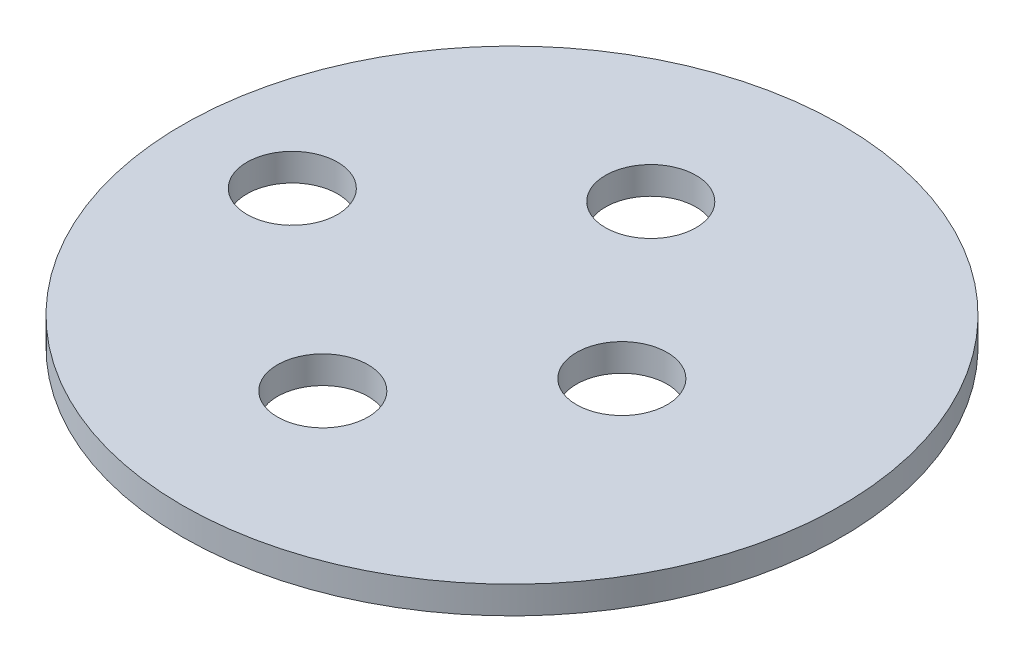
ISO-10303-21;
HEADER;
FILE_DESCRIPTION(('STEP AP214'),'2;1');
FILE_NAME('part.step','',(''),(''),'','','');
FILE_SCHEMA(('AUTOMOTIVE_DESIGN { 1 0 10303 214 1 1 1 1 }'));
ENDSEC;
DATA;
#1=APPLICATION_CONTEXT('core data for automotive mechanical design processes');
#2=APPLICATION_PROTOCOL_DEFINITION('international standard','automotive_design',2000,#1);
#3=PRODUCT_CONTEXT('',#1,'mechanical');
#4=PRODUCT('Part','Part','',(#3));
#5=PRODUCT_RELATED_PRODUCT_CATEGORY('part','',(#4));
#6=PRODUCT_DEFINITION_FORMATION('','',#4);
#7=PRODUCT_DEFINITION_CONTEXT('part definition',#1,'design');
#8=PRODUCT_DEFINITION('design','',#6,#7);
#9=PRODUCT_DEFINITION_SHAPE('','',#8);
#10=(LENGTH_UNIT() NAMED_UNIT(*) SI_UNIT(.MILLI.,.METRE.));
#11=(NAMED_UNIT(*) PLANE_ANGLE_UNIT() SI_UNIT($,.RADIAN.));
#12=(NAMED_UNIT(*) SI_UNIT($,.STERADIAN.) SOLID_ANGLE_UNIT());
#13=UNCERTAINTY_MEASURE_WITH_UNIT(LENGTH_MEASURE(1.E-05),#10,'distance_accuracy_value','');
#14=(GEOMETRIC_REPRESENTATION_CONTEXT(3) GLOBAL_UNCERTAINTY_ASSIGNED_CONTEXT((#13)) GLOBAL_UNIT_ASSIGNED_CONTEXT((#10,
#11,#12)) REPRESENTATION_CONTEXT('',''));
#15=CARTESIAN_POINT('',(0.,0.,0.));
#16=DIRECTION('',(0.,0.,1.));
#17=DIRECTION('',(1.,0.,0.));
#18=AXIS2_PLACEMENT_3D('',#15,#16,#17);
#19=CARTESIAN_POINT('',(0.91884079770432,-1.,0.63738941594364));
#20=DIRECTION('',(0.,1.,0.));
#21=DIRECTION('',(0.,0.,1.));
#22=AXIS2_PLACEMENT_3D('',#19,#20,#21);
#23=CYLINDRICAL_SURFACE('',#22,12.);
#24=CARTESIAN_POINT('',(0.91884079770432,-1.,0.63738941594364));
#25=DIRECTION('',(0.,1.,0.));
#26=DIRECTION('',(0.,0.,1.));
#27=AXIS2_PLACEMENT_3D('',#24,#25,#26);
#28=CIRCLE('',#27,12.);
#29=CARTESIAN_POINT('',(0.91884079770432,-1.,12.6373894159436));
#30=VERTEX_POINT('',#29);
#31=EDGE_CURVE('E11',#30,#30,#28,.T.);
#32=ORIENTED_EDGE('',*,*,#31,.T.);
#33=EDGE_LOOP('',(#32));
#34=FACE_BOUND('',#33,.T.);
#35=CARTESIAN_POINT('',(0.91884079770432,0.,0.63738941594364));
#36=DIRECTION('',(0.,1.,0.));
#37=DIRECTION('',(0.,0.,1.));
#38=AXIS2_PLACEMENT_3D('',#35,#36,#37);
#39=CIRCLE('',#38,12.);
#40=CARTESIAN_POINT('',(0.91884079770432,0.,12.6373894159436));
#41=VERTEX_POINT('',#40);
#42=EDGE_CURVE('E68',#41,#41,#39,.T.);
#43=ORIENTED_EDGE('',*,*,#42,.F.);
#44=EDGE_LOOP('',(#43));
#45=FACE_BOUND('',#44,.T.);
#46=ADVANCED_FACE('F70',(#34,#45),#23,.T.);
#47=CARTESIAN_POINT('',(0.91884079770432,-1.,0.63738941594364));
#48=DIRECTION('',(0.,1.,0.));
#49=DIRECTION('',(0.,0.,1.));
#50=AXIS2_PLACEMENT_3D('',#47,#48,#49);
#51=PLANE('',#50);
#52=CARTESIAN_POINT('',(4.91884079770432,-1.,0.63738941594364));
#53=DIRECTION('',(0.,1.,0.));
#54=DIRECTION('',(0.,0.,1.));
#55=AXIS2_PLACEMENT_3D('',#52,#53,#54);
#56=CIRCLE('',#55,1.65);
#57=CARTESIAN_POINT('',(4.91884079770432,-1.,2.28738941594364));
#58=VERTEX_POINT('',#57);
#59=EDGE_CURVE('E92',#58,#58,#56,.T.);
#60=ORIENTED_EDGE('',*,*,#59,.T.);
#61=EDGE_LOOP('',(#60));
#62=FACE_BOUND('',#61,.T.);
#63=CARTESIAN_POINT('',(-0.138265227612415,-1.,-5.47209809077398));
#64=DIRECTION('',(0.,1.,0.));
#65=DIRECTION('',(0.,0.,1.));
#66=AXIS2_PLACEMENT_3D('',#63,#64,#65);
#67=CIRCLE('',#66,1.65);
#68=CARTESIAN_POINT('',(-0.138265227612415,-1.,-3.82209809077398));
#69=VERTEX_POINT('',#68);
#70=EDGE_CURVE('E88',#69,#69,#67,.T.);
#71=ORIENTED_EDGE('',*,*,#70,.T.);
#72=EDGE_LOOP('',(#71));
#73=FACE_BOUND('',#72,.T.);
#74=CARTESIAN_POINT('',(-0.138265227612415,-1.,6.46994359693563));
#75=DIRECTION('',(0.,1.,0.));
#76=DIRECTION('',(0.,0.,1.));
#77=AXIS2_PLACEMENT_3D('',#74,#75,#76);
#78=CIRCLE('',#77,1.65);
#79=CARTESIAN_POINT('',(-0.138265227612415,-1.,8.11994359693563));
#80=VERTEX_POINT('',#79);
#81=EDGE_CURVE('E85',#80,#80,#78,.T.);
#82=ORIENTED_EDGE('',*,*,#81,.T.);
#83=EDGE_LOOP('',(#82));
#84=FACE_BOUND('',#83,.T.);
#85=CARTESIAN_POINT('',(-7.08115920229568,-1.,0.637389415943641));
#86=DIRECTION('',(0.,1.,0.));
#87=DIRECTION('',(0.,0.,1.));
#88=AXIS2_PLACEMENT_3D('',#85,#86,#87);
#89=CIRCLE('',#88,1.65);
#90=CARTESIAN_POINT('',(-7.08115920229568,-1.,2.28738941594364));
#91=VERTEX_POINT('',#90);
#92=EDGE_CURVE('E77',#91,#91,#89,.T.);
#93=ORIENTED_EDGE('',*,*,#92,.T.);
#94=EDGE_LOOP('',(#93));
#95=FACE_BOUND('',#94,.T.);
#96=ORIENTED_EDGE('',*,*,#31,.F.);
#97=EDGE_LOOP('',(#96));
#98=FACE_BOUND('',#97,.T.);
#99=ADVANCED_FACE('F104',(#62,#73,#84,#95,#98),#51,.F.);
#100=CARTESIAN_POINT('',(0.91884079770432,0.,0.63738941594364));
#101=DIRECTION('',(0.,1.,0.));
#102=DIRECTION('',(0.,0.,1.));
#103=AXIS2_PLACEMENT_3D('',#100,#101,#102);
#104=PLANE('',#103);
#105=CARTESIAN_POINT('',(4.91884079770432,0.,0.63738941594364));
#106=DIRECTION('',(0.,1.,0.));
#107=DIRECTION('',(0.,0.,1.));
#108=AXIS2_PLACEMENT_3D('',#105,#106,#107);
#109=CIRCLE('',#108,1.65);
#110=CARTESIAN_POINT('',(4.91884079770432,0.,2.28738941594364));
#111=VERTEX_POINT('',#110);
#112=EDGE_CURVE('E100',#111,#111,#109,.T.);
#113=ORIENTED_EDGE('',*,*,#112,.F.);
#114=EDGE_LOOP('',(#113));
#115=FACE_BOUND('',#114,.T.);
#116=CARTESIAN_POINT('',(-0.138265227612415,0.,-5.47209809077398));
#117=DIRECTION('',(0.,1.,0.));
#118=DIRECTION('',(0.,0.,1.));
#119=AXIS2_PLACEMENT_3D('',#116,#117,#118);
#120=CIRCLE('',#119,1.65);
#121=CARTESIAN_POINT('',(-0.138265227612415,0.,-3.82209809077398));
#122=VERTEX_POINT('',#121);
#123=EDGE_CURVE('E91',#122,#122,#120,.T.);
#124=ORIENTED_EDGE('',*,*,#123,.F.);
#125=EDGE_LOOP('',(#124));
#126=FACE_BOUND('',#125,.T.);
#127=CARTESIAN_POINT('',(-0.138265227612415,0.,6.46994359693563));
#128=DIRECTION('',(0.,1.,0.));
#129=DIRECTION('',(0.,0.,1.));
#130=AXIS2_PLACEMENT_3D('',#127,#128,#129);
#131=CIRCLE('',#130,1.65);
#132=CARTESIAN_POINT('',(-0.138265227612415,0.,8.11994359693563));
#133=VERTEX_POINT('',#132);
#134=EDGE_CURVE('E82',#133,#133,#131,.T.);
#135=ORIENTED_EDGE('',*,*,#134,.F.);
#136=EDGE_LOOP('',(#135));
#137=FACE_BOUND('',#136,.T.);
#138=CARTESIAN_POINT('',(-7.08115920229568,0.,0.637389415943641));
#139=DIRECTION('',(0.,1.,0.));
#140=DIRECTION('',(0.,0.,1.));
#141=AXIS2_PLACEMENT_3D('',#138,#139,#140);
#142=CIRCLE('',#141,1.65);
#143=CARTESIAN_POINT('',(-7.08115920229568,0.,2.28738941594364));
#144=VERTEX_POINT('',#143);
#145=EDGE_CURVE('E80',#144,#144,#142,.T.);
#146=ORIENTED_EDGE('',*,*,#145,.F.);
#147=EDGE_LOOP('',(#146));
#148=FACE_BOUND('',#147,.T.);
#149=ORIENTED_EDGE('',*,*,#42,.T.);
#150=EDGE_LOOP('',(#149));
#151=FACE_BOUND('',#150,.T.);
#152=ADVANCED_FACE('F111',(#115,#126,#137,#148,#151),#104,.T.);
#153=CARTESIAN_POINT('',(-7.08115920229568,-1.,0.637389415943641));
#154=DIRECTION('',(0.,1.,0.));
#155=DIRECTION('',(0.,0.,1.));
#156=AXIS2_PLACEMENT_3D('',#153,#154,#155);
#157=CYLINDRICAL_SURFACE('',#156,1.65);
#158=ORIENTED_EDGE('',*,*,#92,.F.);
#159=EDGE_LOOP('',(#158));
#160=FACE_BOUND('',#159,.T.);
#161=ORIENTED_EDGE('',*,*,#145,.T.);
#162=EDGE_LOOP('',(#161));
#163=FACE_BOUND('',#162,.T.);
#164=ADVANCED_FACE('F116',(#160,#163),#157,.F.);
#165=CARTESIAN_POINT('',(-0.138265227612415,-1.,6.46994359693563));
#166=DIRECTION('',(0.,1.,0.));
#167=DIRECTION('',(0.,0.,1.));
#168=AXIS2_PLACEMENT_3D('',#165,#166,#167);
#169=CYLINDRICAL_SURFACE('',#168,1.65);
#170=ORIENTED_EDGE('',*,*,#81,.F.);
#171=EDGE_LOOP('',(#170));
#172=FACE_BOUND('',#171,.T.);
#173=ORIENTED_EDGE('',*,*,#134,.T.);
#174=EDGE_LOOP('',(#173));
#175=FACE_BOUND('',#174,.T.);
#176=ADVANCED_FACE('F134',(#172,#175),#169,.F.);
#177=CARTESIAN_POINT('',(-0.138265227612415,-1.,-5.47209809077398));
#178=DIRECTION('',(0.,1.,0.));
#179=DIRECTION('',(0.,0.,1.));
#180=AXIS2_PLACEMENT_3D('',#177,#178,#179);
#181=CYLINDRICAL_SURFACE('',#180,1.65);
#182=ORIENTED_EDGE('',*,*,#70,.F.);
#183=EDGE_LOOP('',(#182));
#184=FACE_BOUND('',#183,.T.);
#185=ORIENTED_EDGE('',*,*,#123,.T.);
#186=EDGE_LOOP('',(#185));
#187=FACE_BOUND('',#186,.T.);
#188=ADVANCED_FACE('F108',(#184,#187),#181,.F.);
#189=CARTESIAN_POINT('',(4.91884079770432,-1.,0.63738941594364));
#190=DIRECTION('',(0.,1.,0.));
#191=DIRECTION('',(0.,0.,1.));
#192=AXIS2_PLACEMENT_3D('',#189,#190,#191);
#193=CYLINDRICAL_SURFACE('',#192,1.65);
#194=ORIENTED_EDGE('',*,*,#59,.F.);
#195=EDGE_LOOP('',(#194));
#196=FACE_BOUND('',#195,.T.);
#197=ORIENTED_EDGE('',*,*,#112,.T.);
#198=EDGE_LOOP('',(#197));
#199=FACE_BOUND('',#198,.T.);
#200=ADVANCED_FACE('F106',(#196,#199),#193,.F.);
#201=CLOSED_SHELL('',(#46,#99,#152,#164,#176,#188,#200));
#202=MANIFOLD_SOLID_BREP('B2',#201);
#203=ADVANCED_BREP_SHAPE_REPRESENTATION('',(#18,#202),#14);
#204=SHAPE_DEFINITION_REPRESENTATION(#9,#203);
ENDSEC;
END-ISO-10303-21;
